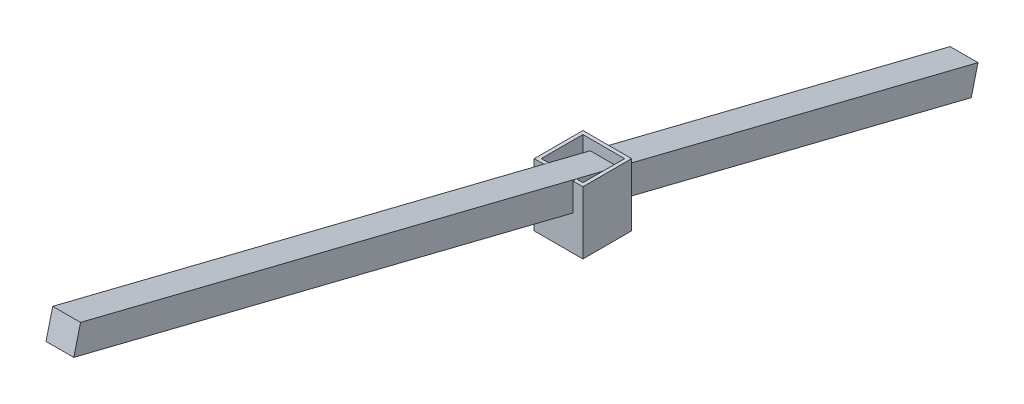
ISO-10303-21;
HEADER;
FILE_DESCRIPTION(('STEP AP214'),'2;1');
FILE_NAME('part.step','',(''),(''),'','','');
FILE_SCHEMA(('AUTOMOTIVE_DESIGN { 1 0 10303 214 1 1 1 1 }'));
ENDSEC;
DATA;
#1=APPLICATION_CONTEXT('core data for automotive mechanical design processes');
#2=APPLICATION_PROTOCOL_DEFINITION('international standard','automotive_design',2000,#1);
#3=PRODUCT_CONTEXT('',#1,'mechanical');
#4=PRODUCT('Part','Part','',(#3));
#5=PRODUCT_RELATED_PRODUCT_CATEGORY('part','',(#4));
#6=PRODUCT_DEFINITION_FORMATION('','',#4);
#7=PRODUCT_DEFINITION_CONTEXT('part definition',#1,'design');
#8=PRODUCT_DEFINITION('design','',#6,#7);
#9=PRODUCT_DEFINITION_SHAPE('','',#8);
#10=(LENGTH_UNIT() NAMED_UNIT(*) SI_UNIT(.MILLI.,.METRE.));
#11=(NAMED_UNIT(*) PLANE_ANGLE_UNIT() SI_UNIT($,.RADIAN.));
#12=(NAMED_UNIT(*) SI_UNIT($,.STERADIAN.) SOLID_ANGLE_UNIT());
#13=UNCERTAINTY_MEASURE_WITH_UNIT(LENGTH_MEASURE(1.E-05),#10,'distance_accuracy_value','');
#14=(GEOMETRIC_REPRESENTATION_CONTEXT(3) GLOBAL_UNCERTAINTY_ASSIGNED_CONTEXT((#13)) GLOBAL_UNIT_ASSIGNED_CONTEXT((#10,
#11,#12)) REPRESENTATION_CONTEXT('',''));
#15=CARTESIAN_POINT('',(0.,0.,0.));
#16=DIRECTION('',(0.,0.,1.));
#17=DIRECTION('',(1.,0.,0.));
#18=AXIS2_PLACEMENT_3D('',#15,#16,#17);
#19=CARTESIAN_POINT('',(-17.5,-45.,-17.5));
#20=DIRECTION('',(0.,0.,-1.));
#21=DIRECTION('',(-1.,0.,0.));
#22=AXIS2_PLACEMENT_3D('',#19,#20,#21);
#23=PLANE('',#22);
#24=DIRECTION('',(0.,-1.,0.));
#25=VECTOR('',#24,1.);
#26=CARTESIAN_POINT('',(10.25,-45.,-17.5));
#27=LINE('',#26,#25);
#28=CARTESIAN_POINT('',(10.25,-8.10316009240324,-17.5));
#29=VERTEX_POINT('',#28);
#30=CARTESIAN_POINT('',(10.25,-28.7154326794012,-17.5));
#31=VERTEX_POINT('',#30);
#32=EDGE_CURVE('E49',#29,#31,#27,.T.);
#33=ORIENTED_EDGE('',*,*,#32,.F.);
#34=DIRECTION('',(1.,0.,0.));
#35=VECTOR('',#34,1.);
#36=CARTESIAN_POINT('',(-17.5,-8.10316009240324,-17.5));
#37=LINE('',#36,#35);
#38=CARTESIAN_POINT('',(-9.74999999999999,-8.10316009240325,-17.5));
#39=VERTEX_POINT('',#38);
#40=EDGE_CURVE('E53',#39,#29,#37,.T.);
#41=ORIENTED_EDGE('',*,*,#40,.F.);
#42=DIRECTION('',(0.,1.,0.));
#43=VECTOR('',#42,1.);
#44=CARTESIAN_POINT('',(-9.74999999999998,-45.,-17.5));
#45=LINE('',#44,#43);
#46=CARTESIAN_POINT('',(-9.74999999999998,-28.7154326794012,-17.5000000000001));
#47=VERTEX_POINT('',#46);
#48=EDGE_CURVE('E240',#47,#39,#45,.T.);
#49=ORIENTED_EDGE('',*,*,#48,.F.);
#50=DIRECTION('',(-1.,0.,0.));
#51=VECTOR('',#50,1.);
#52=CARTESIAN_POINT('',(-17.5,-28.7154326794012,-17.5));
#53=LINE('',#52,#51);
#54=EDGE_CURVE('E230',#31,#47,#53,.T.);
#55=ORIENTED_EDGE('',*,*,#54,.F.);
#56=EDGE_LOOP('',(#33,#41,#49,#55));
#57=FACE_BOUND('',#56,.T.);
#58=DIRECTION('',(-1.,0.,0.));
#59=VECTOR('',#58,1.);
#60=CARTESIAN_POINT('',(-17.5,0.,-17.5));
#61=LINE('',#60,#59);
#62=CARTESIAN_POINT('',(17.5,0.,-17.5));
#63=VERTEX_POINT('',#62);
#64=CARTESIAN_POINT('',(-17.5,0.,-17.5));
#65=VERTEX_POINT('',#64);
#66=EDGE_CURVE('E280',#63,#65,#61,.T.);
#67=ORIENTED_EDGE('',*,*,#66,.F.);
#68=DIRECTION('',(0.,1.,0.));
#69=VECTOR('',#68,1.);
#70=CARTESIAN_POINT('',(17.5,-45.,-17.5));
#71=LINE('',#70,#69);
#72=CARTESIAN_POINT('',(17.5,-45.,-17.5));
#73=VERTEX_POINT('',#72);
#74=EDGE_CURVE('E312',#73,#63,#71,.T.);
#75=ORIENTED_EDGE('',*,*,#74,.F.);
#76=DIRECTION('',(-1.,0.,0.));
#77=VECTOR('',#76,1.);
#78=CARTESIAN_POINT('',(-17.5,-45.,-17.5));
#79=LINE('',#78,#77);
#80=CARTESIAN_POINT('',(-17.5,-45.,-17.5));
#81=VERTEX_POINT('',#80);
#82=EDGE_CURVE('E287',#73,#81,#79,.T.);
#83=ORIENTED_EDGE('',*,*,#82,.T.);
#84=DIRECTION('',(0.,1.,0.));
#85=VECTOR('',#84,1.);
#86=CARTESIAN_POINT('',(-17.5,-45.,-17.5));
#87=LINE('',#86,#85);
#88=EDGE_CURVE('E300',#81,#65,#87,.T.);
#89=ORIENTED_EDGE('',*,*,#88,.T.);
#90=EDGE_LOOP('',(#67,#75,#83,#89));
#91=FACE_BOUND('',#90,.T.);
#92=ADVANCED_FACE('F35',(#57,#91),#23,.T.);
#93=CARTESIAN_POINT('',(17.5,-45.,-17.5));
#94=DIRECTION('',(1.,0.,0.));
#95=DIRECTION('',(0.,0.,-1.));
#96=AXIS2_PLACEMENT_3D('',#93,#94,#95);
#97=PLANE('',#96);
#98=DIRECTION('',(0.,0.,-1.));
#99=VECTOR('',#98,1.);
#100=CARTESIAN_POINT('',(17.5,0.,-17.5));
#101=LINE('',#100,#99);
#102=CARTESIAN_POINT('',(17.5,0.,17.5));
#103=VERTEX_POINT('',#102);
#104=EDGE_CURVE('E291',#103,#63,#101,.T.);
#105=ORIENTED_EDGE('',*,*,#104,.F.);
#106=DIRECTION('',(0.,1.,0.));
#107=VECTOR('',#106,1.);
#108=CARTESIAN_POINT('',(17.5,-45.,17.5));
#109=LINE('',#108,#107);
#110=CARTESIAN_POINT('',(17.5,-45.,17.5));
#111=VERTEX_POINT('',#110);
#112=EDGE_CURVE('E315',#111,#103,#109,.T.);
#113=ORIENTED_EDGE('',*,*,#112,.F.);
#114=DIRECTION('',(0.,0.,-1.));
#115=VECTOR('',#114,1.);
#116=CARTESIAN_POINT('',(17.5,-45.,-17.5));
#117=LINE('',#116,#115);
#118=EDGE_CURVE('E297',#111,#73,#117,.T.);
#119=ORIENTED_EDGE('',*,*,#118,.T.);
#120=ORIENTED_EDGE('',*,*,#74,.T.);
#121=EDGE_LOOP('',(#105,#113,#119,#120));
#122=FACE_BOUND('',#121,.T.);
#123=ADVANCED_FACE('F358',(#122),#97,.T.);
#124=CARTESIAN_POINT('',(-17.5,-45.,17.5));
#125=DIRECTION('',(0.,0.,1.));
#126=DIRECTION('',(1.,0.,0.));
#127=AXIS2_PLACEMENT_3D('',#124,#125,#126);
#128=PLANE('',#127);
#129=DIRECTION('',(0.,1.,0.));
#130=VECTOR('',#129,1.);
#131=CARTESIAN_POINT('',(10.25,-45.,17.5));
#132=LINE('',#131,#130);
#133=CARTESIAN_POINT('',(10.25,-19.9889525798901,17.5));
#134=VERTEX_POINT('',#133);
#135=CARTESIAN_POINT('',(10.25,0.,17.5));
#136=VERTEX_POINT('',#135);
#137=EDGE_CURVE('E249',#134,#136,#132,.T.);
#138=ORIENTED_EDGE('',*,*,#137,.F.);
#139=DIRECTION('',(1.,0.,0.));
#140=VECTOR('',#139,1.);
#141=CARTESIAN_POINT('',(-17.5,-19.9889525798901,17.5));
#142=LINE('',#141,#140);
#143=CARTESIAN_POINT('',(-9.74999999999998,-19.9889525798901,17.5));
#144=VERTEX_POINT('',#143);
#145=EDGE_CURVE('E228',#144,#134,#142,.T.);
#146=ORIENTED_EDGE('',*,*,#145,.F.);
#147=DIRECTION('',(0.,-1.,0.));
#148=VECTOR('',#147,1.);
#149=CARTESIAN_POINT('',(-9.74999999999998,-45.,17.5));
#150=LINE('',#149,#148);
#151=CARTESIAN_POINT('',(-9.74999999999999,0.,17.5));
#152=VERTEX_POINT('',#151);
#153=EDGE_CURVE('E238',#152,#144,#150,.T.);
#154=ORIENTED_EDGE('',*,*,#153,.F.);
#155=DIRECTION('',(1.,0.,0.));
#156=VECTOR('',#155,1.);
#157=CARTESIAN_POINT('',(-17.5,0.,17.5));
#158=LINE('',#157,#156);
#159=CARTESIAN_POINT('',(-17.5,0.,17.5));
#160=VERTEX_POINT('',#159);
#161=EDGE_CURVE('E307',#160,#152,#158,.T.);
#162=ORIENTED_EDGE('',*,*,#161,.F.);
#163=DIRECTION('',(0.,1.,0.));
#164=VECTOR('',#163,1.);
#165=CARTESIAN_POINT('',(-17.5,-45.,17.5));
#166=LINE('',#165,#164);
#167=CARTESIAN_POINT('',(-17.5,-45.,17.5));
#168=VERTEX_POINT('',#167);
#169=EDGE_CURVE('E318',#168,#160,#166,.T.);
#170=ORIENTED_EDGE('',*,*,#169,.F.);
#171=DIRECTION('',(1.,0.,0.));
#172=VECTOR('',#171,1.);
#173=CARTESIAN_POINT('',(-17.5,-45.,17.5));
#174=LINE('',#173,#172);
#175=EDGE_CURVE('E294',#168,#111,#174,.T.);
#176=ORIENTED_EDGE('',*,*,#175,.T.);
#177=ORIENTED_EDGE('',*,*,#112,.T.);
#178=EDGE_CURVE('E306',#136,#103,#158,.T.);
#179=ORIENTED_EDGE('',*,*,#178,.F.);
#180=EDGE_LOOP('',(#138,#146,#154,#162,#170,#176,#177,#179));
#181=FACE_BOUND('',#180,.T.);
#182=ADVANCED_FACE('F364',(#181),#128,.T.);
#183=CARTESIAN_POINT('',(-17.5,-45.,-17.5));
#184=DIRECTION('',(-1.,0.,0.));
#185=DIRECTION('',(0.,0.,1.));
#186=AXIS2_PLACEMENT_3D('',#183,#184,#185);
#187=PLANE('',#186);
#188=DIRECTION('',(0.,0.,1.));
#189=VECTOR('',#188,1.);
#190=CARTESIAN_POINT('',(-17.5,0.,-17.5));
#191=LINE('',#190,#189);
#192=EDGE_CURVE('E303',#65,#160,#191,.T.);
#193=ORIENTED_EDGE('',*,*,#192,.F.);
#194=ORIENTED_EDGE('',*,*,#88,.F.);
#195=DIRECTION('',(0.,0.,1.));
#196=VECTOR('',#195,1.);
#197=CARTESIAN_POINT('',(-17.5,-45.,-17.5));
#198=LINE('',#197,#196);
#199=EDGE_CURVE('E290',#81,#168,#198,.T.);
#200=ORIENTED_EDGE('',*,*,#199,.T.);
#201=ORIENTED_EDGE('',*,*,#169,.T.);
#202=EDGE_LOOP('',(#193,#194,#200,#201));
#203=FACE_BOUND('',#202,.T.);
#204=ADVANCED_FACE('F382',(#203),#187,.T.);
#205=CARTESIAN_POINT('',(0.,-45.,0.));
#206=DIRECTION('',(0.,-1.,0.));
#207=DIRECTION('',(0.,0.,-1.));
#208=AXIS2_PLACEMENT_3D('',#205,#206,#207);
#209=PLANE('',#208);
#210=DIRECTION('',(0.,0.,-1.));
#211=VECTOR('',#210,1.);
#212=CARTESIAN_POINT('',(15.,-45.,-15.));
#213=LINE('',#212,#211);
#214=CARTESIAN_POINT('',(15.,-45.,15.));
#215=VERTEX_POINT('',#214);
#216=CARTESIAN_POINT('',(15.,-45.,-15.));
#217=VERTEX_POINT('',#216);
#218=EDGE_CURVE('E253',#215,#217,#213,.T.);
#219=ORIENTED_EDGE('',*,*,#218,.T.);
#220=DIRECTION('',(-1.,0.,0.));
#221=VECTOR('',#220,1.);
#222=CARTESIAN_POINT('',(-15.,-45.,-15.));
#223=LINE('',#222,#221);
#224=CARTESIAN_POINT('',(-15.,-45.,-15.));
#225=VERTEX_POINT('',#224);
#226=EDGE_CURVE('E256',#217,#225,#223,.T.);
#227=ORIENTED_EDGE('',*,*,#226,.T.);
#228=DIRECTION('',(0.,0.,1.));
#229=VECTOR('',#228,1.);
#230=CARTESIAN_POINT('',(-15.,-45.,-15.));
#231=LINE('',#230,#229);
#232=CARTESIAN_POINT('',(-15.,-45.,15.));
#233=VERTEX_POINT('',#232);
#234=EDGE_CURVE('E260',#225,#233,#231,.T.);
#235=ORIENTED_EDGE('',*,*,#234,.T.);
#236=DIRECTION('',(1.,0.,0.));
#237=VECTOR('',#236,1.);
#238=CARTESIAN_POINT('',(-15.,-45.,15.));
#239=LINE('',#238,#237);
#240=EDGE_CURVE('E263',#233,#215,#239,.T.);
#241=ORIENTED_EDGE('',*,*,#240,.T.);
#242=EDGE_LOOP('',(#219,#227,#235,#241));
#243=FACE_BOUND('',#242,.T.);
#244=ORIENTED_EDGE('',*,*,#82,.F.);
#245=ORIENTED_EDGE('',*,*,#118,.F.);
#246=ORIENTED_EDGE('',*,*,#175,.F.);
#247=ORIENTED_EDGE('',*,*,#199,.F.);
#248=EDGE_LOOP('',(#244,#245,#246,#247));
#249=FACE_BOUND('',#248,.T.);
#250=ADVANCED_FACE('F379',(#243,#249),#209,.T.);
#251=CARTESIAN_POINT('',(0.,0.,0.));
#252=DIRECTION('',(0.,-1.,0.));
#253=DIRECTION('',(0.,0.,-1.));
#254=AXIS2_PLACEMENT_3D('',#251,#252,#253);
#255=PLANE('',#254);
#256=DIRECTION('',(1.,0.,0.));
#257=VECTOR('',#256,1.);
#258=CARTESIAN_POINT('',(-15.,0.,15.));
#259=LINE('',#258,#257);
#260=CARTESIAN_POINT('',(10.25,-1.11022302462516E-13,15.));
#261=VERTEX_POINT('',#260);
#262=CARTESIAN_POINT('',(15.,0.,15.));
#263=VERTEX_POINT('',#262);
#264=EDGE_CURVE('E274',#261,#263,#259,.T.);
#265=ORIENTED_EDGE('',*,*,#264,.F.);
#266=DIRECTION('',(0.,0.,1.));
#267=VECTOR('',#266,1.);
#268=CARTESIAN_POINT('',(10.25,0.,0.));
#269=LINE('',#268,#267);
#270=EDGE_CURVE('E246',#261,#136,#269,.T.);
#271=ORIENTED_EDGE('',*,*,#270,.T.);
#272=ORIENTED_EDGE('',*,*,#178,.T.);
#273=ORIENTED_EDGE('',*,*,#104,.T.);
#274=ORIENTED_EDGE('',*,*,#66,.T.);
#275=ORIENTED_EDGE('',*,*,#192,.T.);
#276=ORIENTED_EDGE('',*,*,#161,.T.);
#277=DIRECTION('',(0.,0.,-1.));
#278=VECTOR('',#277,1.);
#279=CARTESIAN_POINT('',(-9.74999999999999,0.,0.));
#280=LINE('',#279,#278);
#281=CARTESIAN_POINT('',(-9.74999999999999,0.,15.));
#282=VERTEX_POINT('',#281);
#283=EDGE_CURVE('E235',#152,#282,#280,.T.);
#284=ORIENTED_EDGE('',*,*,#283,.T.);
#285=CARTESIAN_POINT('',(-15.,0.,15.));
#286=VERTEX_POINT('',#285);
#287=EDGE_CURVE('E257',#286,#282,#259,.T.);
#288=ORIENTED_EDGE('',*,*,#287,.F.);
#289=DIRECTION('',(0.,0.,1.));
#290=VECTOR('',#289,1.);
#291=CARTESIAN_POINT('',(-15.,0.,-15.));
#292=LINE('',#291,#290);
#293=CARTESIAN_POINT('',(-15.,0.,-15.));
#294=VERTEX_POINT('',#293);
#295=EDGE_CURVE('E271',#294,#286,#292,.T.);
#296=ORIENTED_EDGE('',*,*,#295,.F.);
#297=DIRECTION('',(-1.,0.,0.));
#298=VECTOR('',#297,1.);
#299=CARTESIAN_POINT('',(-15.,0.,-15.));
#300=LINE('',#299,#298);
#301=CARTESIAN_POINT('',(15.,0.,-15.));
#302=VERTEX_POINT('',#301);
#303=EDGE_CURVE('E268',#302,#294,#300,.T.);
#304=ORIENTED_EDGE('',*,*,#303,.F.);
#305=DIRECTION('',(0.,0.,-1.));
#306=VECTOR('',#305,1.);
#307=CARTESIAN_POINT('',(15.,0.,-15.));
#308=LINE('',#307,#306);
#309=EDGE_CURVE('E252',#263,#302,#308,.T.);
#310=ORIENTED_EDGE('',*,*,#309,.F.);
#311=EDGE_LOOP('',(#265,#271,#272,#273,#274,#275,#276,#284,#288,#296,#304,#310));
#312=FACE_BOUND('',#311,.T.);
#313=ADVANCED_FACE('F374',(#312),#255,.F.);
#314=CARTESIAN_POINT('',(15.,-45.,-15.));
#315=DIRECTION('',(1.,0.,0.));
#316=DIRECTION('',(0.,0.,-1.));
#317=AXIS2_PLACEMENT_3D('',#314,#315,#316);
#318=PLANE('',#317);
#319=ORIENTED_EDGE('',*,*,#309,.T.);
#320=DIRECTION('',(0.,1.,0.));
#321=VECTOR('',#320,1.);
#322=CARTESIAN_POINT('',(15.,-45.,-15.));
#323=LINE('',#322,#321);
#324=EDGE_CURVE('E266',#217,#302,#323,.T.);
#325=ORIENTED_EDGE('',*,*,#324,.F.);
#326=ORIENTED_EDGE('',*,*,#218,.F.);
#327=DIRECTION('',(0.,1.,0.));
#328=VECTOR('',#327,1.);
#329=CARTESIAN_POINT('',(15.,-45.,15.));
#330=LINE('',#329,#328);
#331=EDGE_CURVE('E277',#215,#263,#330,.T.);
#332=ORIENTED_EDGE('',*,*,#331,.T.);
#333=EDGE_LOOP('',(#319,#325,#326,#332));
#334=FACE_BOUND('',#333,.T.);
#335=ADVANCED_FACE('F408',(#334),#318,.F.);
#336=CARTESIAN_POINT('',(-15.,-45.,15.));
#337=DIRECTION('',(0.,0.,1.));
#338=DIRECTION('',(1.,0.,0.));
#339=AXIS2_PLACEMENT_3D('',#336,#337,#338);
#340=PLANE('',#339);
#341=DIRECTION('',(1.,0.,0.));
#342=VECTOR('',#341,1.);
#343=CARTESIAN_POINT('',(-15.,-20.612272586998,15.));
#344=LINE('',#343,#342);
#345=CARTESIAN_POINT('',(-9.74999999999998,-20.612272586998,15.));
#346=VERTEX_POINT('',#345);
#347=CARTESIAN_POINT('',(10.25,-20.612272586998,15.));
#348=VERTEX_POINT('',#347);
#349=EDGE_CURVE('E213',#346,#348,#344,.T.);
#350=ORIENTED_EDGE('',*,*,#349,.T.);
#351=DIRECTION('',(0.,1.,0.));
#352=VECTOR('',#351,1.);
#353=CARTESIAN_POINT('',(10.25,-45.,15.));
#354=LINE('',#353,#352);
#355=EDGE_CURVE('E243',#348,#261,#354,.T.);
#356=ORIENTED_EDGE('',*,*,#355,.T.);
#357=ORIENTED_EDGE('',*,*,#264,.T.);
#358=ORIENTED_EDGE('',*,*,#331,.F.);
#359=ORIENTED_EDGE('',*,*,#240,.F.);
#360=DIRECTION('',(0.,1.,0.));
#361=VECTOR('',#360,1.);
#362=CARTESIAN_POINT('',(-15.,-45.,15.));
#363=LINE('',#362,#361);
#364=EDGE_CURVE('E281',#233,#286,#363,.T.);
#365=ORIENTED_EDGE('',*,*,#364,.T.);
#366=ORIENTED_EDGE('',*,*,#287,.T.);
#367=DIRECTION('',(0.,-1.,0.));
#368=VECTOR('',#367,1.);
#369=CARTESIAN_POINT('',(-9.74999999999998,-45.,15.));
#370=LINE('',#369,#368);
#371=EDGE_CURVE('E232',#282,#346,#370,.T.);
#372=ORIENTED_EDGE('',*,*,#371,.T.);
#373=EDGE_LOOP('',(#350,#356,#357,#358,#359,#365,#366,#372));
#374=FACE_BOUND('',#373,.T.);
#375=ADVANCED_FACE('F401',(#374),#340,.F.);
#376=CARTESIAN_POINT('',(-15.,-45.,-15.));
#377=DIRECTION('',(-1.,0.,0.));
#378=DIRECTION('',(0.,0.,1.));
#379=AXIS2_PLACEMENT_3D('',#376,#377,#378);
#380=PLANE('',#379);
#381=ORIENTED_EDGE('',*,*,#295,.T.);
#382=ORIENTED_EDGE('',*,*,#364,.F.);
#383=ORIENTED_EDGE('',*,*,#234,.F.);
#384=DIRECTION('',(0.,1.,0.));
#385=VECTOR('',#384,1.);
#386=CARTESIAN_POINT('',(-15.,-45.,-15.));
#387=LINE('',#386,#385);
#388=EDGE_CURVE('E283',#225,#294,#387,.T.);
#389=ORIENTED_EDGE('',*,*,#388,.T.);
#390=EDGE_LOOP('',(#381,#382,#383,#389));
#391=FACE_BOUND('',#390,.T.);
#392=ADVANCED_FACE('F415',(#391),#380,.F.);
#393=CARTESIAN_POINT('',(-15.,-45.,-15.));
#394=DIRECTION('',(0.,0.,-1.));
#395=DIRECTION('',(-1.,0.,0.));
#396=AXIS2_PLACEMENT_3D('',#393,#394,#395);
#397=PLANE('',#396);
#398=DIRECTION('',(1.,0.,0.));
#399=VECTOR('',#398,1.);
#400=CARTESIAN_POINT('',(-15.,-7.47984008529531,-15.));
#401=LINE('',#400,#399);
#402=CARTESIAN_POINT('',(-9.74999999999999,-7.47984008529531,-15.));
#403=VERTEX_POINT('',#402);
#404=CARTESIAN_POINT('',(10.25,-7.47984008529533,-15.));
#405=VERTEX_POINT('',#404);
#406=EDGE_CURVE('E42',#403,#405,#401,.T.);
#407=ORIENTED_EDGE('',*,*,#406,.T.);
#408=DIRECTION('',(0.,-1.,0.));
#409=VECTOR('',#408,1.);
#410=CARTESIAN_POINT('',(10.25,-45.,-15.));
#411=LINE('',#410,#409);
#412=CARTESIAN_POINT('',(10.25,-28.0921126722933,-15.));
#413=VERTEX_POINT('',#412);
#414=EDGE_CURVE('E11',#405,#413,#411,.T.);
#415=ORIENTED_EDGE('',*,*,#414,.T.);
#416=DIRECTION('',(-1.,0.,0.));
#417=VECTOR('',#416,1.);
#418=CARTESIAN_POINT('',(-15.,-28.0921126722933,-15.));
#419=LINE('',#418,#417);
#420=CARTESIAN_POINT('',(-9.75000000000001,-28.0921126722933,-15.));
#421=VERTEX_POINT('',#420);
#422=EDGE_CURVE('E314',#413,#421,#419,.T.);
#423=ORIENTED_EDGE('',*,*,#422,.T.);
#424=DIRECTION('',(0.,1.,0.));
#425=VECTOR('',#424,1.);
#426=CARTESIAN_POINT('',(-9.74999999999998,-45.,-15.));
#427=LINE('',#426,#425);
#428=EDGE_CURVE('E323',#421,#403,#427,.T.);
#429=ORIENTED_EDGE('',*,*,#428,.T.);
#430=EDGE_LOOP('',(#407,#415,#423,#429));
#431=FACE_BOUND('',#430,.T.);
#432=ORIENTED_EDGE('',*,*,#303,.T.);
#433=ORIENTED_EDGE('',*,*,#388,.F.);
#434=ORIENTED_EDGE('',*,*,#226,.F.);
#435=ORIENTED_EDGE('',*,*,#324,.T.);
#436=EDGE_LOOP('',(#432,#433,#434,#435));
#437=FACE_BOUND('',#436,.T.);
#438=ADVANCED_FACE('F327',(#431,#437),#397,.F.);
#439=CARTESIAN_POINT('',(0.,92.391402782736,370.561676703639));
#440=DIRECTION('',(0.,-0.241921895599661,-0.970295726275998));
#441=DIRECTION('',(0.,0.970295726275998,-0.241921895599661));
#442=AXIS2_PLACEMENT_3D('',#439,#440,#441);
#443=PLANE('',#442);
#444=DIRECTION('',(0.,-0.970295726275998,0.241921895599661));
#445=VECTOR('',#444,1.);
#446=CARTESIAN_POINT('',(10.25,88.8703660618418,371.439569757197));
#447=LINE('',#446,#445);
#448=CARTESIAN_POINT('',(10.25,88.8703660618418,371.439569757197));
#449=VERTEX_POINT('',#448);
#450=CARTESIAN_POINT('',(10.25,69.4644515363218,376.27800766919));
#451=VERTEX_POINT('',#450);
#452=EDGE_CURVE('E199',#449,#451,#447,.T.);
#453=ORIENTED_EDGE('',*,*,#452,.F.);
#454=DIRECTION('',(1.,0.,0.));
#455=VECTOR('',#454,1.);
#456=CARTESIAN_POINT('',(10.25,88.8703660618418,371.439569757197));
#457=LINE('',#456,#455);
#458=CARTESIAN_POINT('',(-9.75000000000001,88.8703660618418,371.439569757197));
#459=VERTEX_POINT('',#458);
#460=EDGE_CURVE('E178',#459,#449,#457,.T.);
#461=ORIENTED_EDGE('',*,*,#460,.F.);
#462=DIRECTION('',(0.,0.970295726275998,-0.241921895599661));
#463=VECTOR('',#462,1.);
#464=CARTESIAN_POINT('',(-9.75000000000001,88.8703660618418,371.439569757197));
#465=LINE('',#464,#463);
#466=CARTESIAN_POINT('',(-9.75000000000001,69.4644515363218,376.27800766919));
#467=VERTEX_POINT('',#466);
#468=EDGE_CURVE('E205',#467,#459,#465,.T.);
#469=ORIENTED_EDGE('',*,*,#468,.F.);
#470=DIRECTION('',(-1.,0.,0.));
#471=VECTOR('',#470,1.);
#472=CARTESIAN_POINT('',(10.25,69.4644515363218,376.27800766919));
#473=LINE('',#472,#471);
#474=EDGE_CURVE('E202',#451,#467,#473,.T.);
#475=ORIENTED_EDGE('',*,*,#474,.F.);
#476=EDGE_LOOP('',(#453,#461,#469,#475));
#477=FACE_BOUND('',#476,.T.);
#478=ADVANCED_FACE('F396',(#477),#443,.F.);
#479=CARTESIAN_POINT('',(10.25,88.8703660618418,371.439569757197));
#480=DIRECTION('',(1.,0.,0.));
#481=DIRECTION('',(0.,1.,0.));
#482=AXIS2_PLACEMENT_3D('',#479,#480,#481);
#483=PLANE('',#482);
#484=DIRECTION('',(0.,-0.241921895599661,-0.970295726275998));
#485=VECTOR('',#484,1.);
#486=CARTESIAN_POINT('',(10.25,69.4644515363218,376.27800766919));
#487=LINE('',#486,#485);
#488=EDGE_CURVE('E180',#451,#134,#487,.T.);
#489=ORIENTED_EDGE('',*,*,#488,.T.);
#490=ORIENTED_EDGE('',*,*,#137,.T.);
#491=ORIENTED_EDGE('',*,*,#270,.F.);
#492=DIRECTION('',(0.,-0.241921895599661,-0.970295726275998));
#493=VECTOR('',#492,1.);
#494=CARTESIAN_POINT('',(10.25,88.8703660618418,371.439569757197));
#495=LINE('',#494,#493);
#496=EDGE_CURVE('E210',#449,#261,#495,.T.);
#497=ORIENTED_EDGE('',*,*,#496,.F.);
#498=ORIENTED_EDGE('',*,*,#452,.T.);
#499=EDGE_LOOP('',(#489,#490,#491,#497,#498));
#500=FACE_BOUND('',#499,.T.);
#501=ADVANCED_FACE('F354',(#500),#483,.T.);
#502=CARTESIAN_POINT('',(-9.75000000000001,88.8703660618418,371.439569757197));
#503=DIRECTION('',(-1.,0.,0.));
#504=DIRECTION('',(0.,-1.,0.));
#505=AXIS2_PLACEMENT_3D('',#502,#503,#504);
#506=PLANE('',#505);
#507=ORIENTED_EDGE('',*,*,#283,.F.);
#508=ORIENTED_EDGE('',*,*,#153,.T.);
#509=DIRECTION('',(0.,-0.241921895599661,-0.970295726275998));
#510=VECTOR('',#509,1.);
#511=CARTESIAN_POINT('',(-9.75000000000001,69.4644515363218,376.27800766919));
#512=LINE('',#511,#510);
#513=EDGE_CURVE('E221',#467,#144,#512,.T.);
#514=ORIENTED_EDGE('',*,*,#513,.F.);
#515=ORIENTED_EDGE('',*,*,#468,.T.);
#516=DIRECTION('',(0.,-0.241921895599661,-0.970295726275998));
#517=VECTOR('',#516,1.);
#518=CARTESIAN_POINT('',(-9.75000000000001,88.8703660618418,371.439569757197));
#519=LINE('',#518,#517);
#520=EDGE_CURVE('E216',#459,#282,#519,.T.);
#521=ORIENTED_EDGE('',*,*,#520,.T.);
#522=EDGE_LOOP('',(#507,#508,#514,#515,#521));
#523=FACE_BOUND('',#522,.T.);
#524=ADVANCED_FACE('F351',(#523),#506,.T.);
#525=CARTESIAN_POINT('',(10.25,69.4644515363218,376.27800766919));
#526=DIRECTION('',(0.,-0.970295726275998,0.241921895599661));
#527=DIRECTION('',(0.,-0.241921895599661,-0.970295726275998));
#528=AXIS2_PLACEMENT_3D('',#525,#526,#527);
#529=PLANE('',#528);
#530=ORIENTED_EDGE('',*,*,#513,.T.);
#531=ORIENTED_EDGE('',*,*,#145,.T.);
#532=ORIENTED_EDGE('',*,*,#488,.F.);
#533=ORIENTED_EDGE('',*,*,#474,.T.);
#534=EDGE_LOOP('',(#530,#531,#532,#533));
#535=FACE_BOUND('',#534,.T.);
#536=ADVANCED_FACE('F392',(#535),#529,.T.);
#537=ORIENTED_EDGE('',*,*,#349,.F.);
#538=EDGE_CURVE('E223',#346,#421,#512,.T.);
#539=ORIENTED_EDGE('',*,*,#538,.T.);
#540=ORIENTED_EDGE('',*,*,#422,.F.);
#541=EDGE_CURVE('E177',#348,#413,#487,.T.);
#542=ORIENTED_EDGE('',*,*,#541,.F.);
#543=EDGE_LOOP('',(#537,#539,#540,#542));
#544=FACE_BOUND('',#543,.T.);
#545=ADVANCED_FACE('F491',(#544),#529,.T.);
#546=ORIENTED_EDGE('',*,*,#371,.F.);
#547=EDGE_CURVE('E219',#282,#403,#519,.T.);
#548=ORIENTED_EDGE('',*,*,#547,.T.);
#549=ORIENTED_EDGE('',*,*,#428,.F.);
#550=ORIENTED_EDGE('',*,*,#538,.F.);
#551=EDGE_LOOP('',(#546,#548,#549,#550));
#552=FACE_BOUND('',#551,.T.);
#553=ADVANCED_FACE('F337',(#552),#506,.T.);
#554=CARTESIAN_POINT('',(10.25,88.8703660618418,371.439569757197));
#555=DIRECTION('',(0.,0.970295726275998,-0.241921895599661));
#556=DIRECTION('',(0.,0.241921895599661,0.970295726275998));
#557=AXIS2_PLACEMENT_3D('',#554,#555,#556);
#558=PLANE('',#557);
#559=ORIENTED_EDGE('',*,*,#547,.F.);
#560=ORIENTED_EDGE('',*,*,#520,.F.);
#561=ORIENTED_EDGE('',*,*,#460,.T.);
#562=ORIENTED_EDGE('',*,*,#496,.T.);
#563=EDGE_CURVE('E214',#261,#405,#495,.T.);
#564=ORIENTED_EDGE('',*,*,#563,.T.);
#565=ORIENTED_EDGE('',*,*,#406,.F.);
#566=EDGE_LOOP('',(#559,#560,#561,#562,#564,#565));
#567=FACE_BOUND('',#566,.T.);
#568=ADVANCED_FACE('F334',(#567),#558,.T.);
#569=ORIENTED_EDGE('',*,*,#355,.F.);
#570=ORIENTED_EDGE('',*,*,#541,.T.);
#571=ORIENTED_EDGE('',*,*,#414,.F.);
#572=ORIENTED_EDGE('',*,*,#563,.F.);
#573=EDGE_LOOP('',(#569,#570,#571,#572));
#574=FACE_BOUND('',#573,.T.);
#575=ADVANCED_FACE('F352',(#574),#483,.T.);
#576=CARTESIAN_POINT('',(10.25,-72.0076945119329,-273.807088216342));
#577=VERTEX_POINT('',#576);
#578=EDGE_CURVE('E215',#29,#577,#495,.T.);
#579=ORIENTED_EDGE('',*,*,#578,.F.);
#580=ORIENTED_EDGE('',*,*,#32,.T.);
#581=CARTESIAN_POINT('',(10.25,-91.4136090374529,-268.968650304349));
#582=VERTEX_POINT('',#581);
#583=EDGE_CURVE('E169',#31,#582,#487,.T.);
#584=ORIENTED_EDGE('',*,*,#583,.T.);
#585=DIRECTION('',(0.,-0.970295726275998,0.241921895599661));
#586=VECTOR('',#585,1.);
#587=CARTESIAN_POINT('',(10.25,-72.0076945119329,-273.807088216342));
#588=LINE('',#587,#586);
#589=EDGE_CURVE('E174',#577,#582,#588,.T.);
#590=ORIENTED_EDGE('',*,*,#589,.F.);
#591=EDGE_LOOP('',(#579,#580,#584,#590));
#592=FACE_BOUND('',#591,.T.);
#593=ADVANCED_FACE('F172',(#592),#483,.T.);
#594=CARTESIAN_POINT('',(-9.74999999999997,-72.0076945119329,-273.807088216342));
#595=VERTEX_POINT('',#594);
#596=EDGE_CURVE('E220',#39,#595,#519,.T.);
#597=ORIENTED_EDGE('',*,*,#596,.F.);
#598=ORIENTED_EDGE('',*,*,#40,.T.);
#599=ORIENTED_EDGE('',*,*,#578,.T.);
#600=DIRECTION('',(1.,0.,0.));
#601=VECTOR('',#600,1.);
#602=CARTESIAN_POINT('',(10.25,-72.0076945119329,-273.807088216342));
#603=LINE('',#602,#601);
#604=EDGE_CURVE('E194',#595,#577,#603,.T.);
#605=ORIENTED_EDGE('',*,*,#604,.F.);
#606=EDGE_LOOP('',(#597,#598,#599,#605));
#607=FACE_BOUND('',#606,.T.);
#608=ADVANCED_FACE('F343',(#607),#558,.T.);
#609=CARTESIAN_POINT('',(-9.74999999999996,-91.4136090374529,-268.968650304349));
#610=VERTEX_POINT('',#609);
#611=EDGE_CURVE('E185',#47,#610,#512,.T.);
#612=ORIENTED_EDGE('',*,*,#611,.F.);
#613=ORIENTED_EDGE('',*,*,#48,.T.);
#614=ORIENTED_EDGE('',*,*,#596,.T.);
#615=DIRECTION('',(0.,0.970295726275998,-0.241921895599661));
#616=VECTOR('',#615,1.);
#617=CARTESIAN_POINT('',(-9.74999999999997,-72.0076945119329,-273.807088216342));
#618=LINE('',#617,#616);
#619=EDGE_CURVE('E189',#610,#595,#618,.T.);
#620=ORIENTED_EDGE('',*,*,#619,.F.);
#621=EDGE_LOOP('',(#612,#613,#614,#620));
#622=FACE_BOUND('',#621,.T.);
#623=ADVANCED_FACE('F341',(#622),#506,.T.);
#624=ORIENTED_EDGE('',*,*,#583,.F.);
#625=ORIENTED_EDGE('',*,*,#54,.T.);
#626=ORIENTED_EDGE('',*,*,#611,.T.);
#627=DIRECTION('',(-1.,0.,0.));
#628=VECTOR('',#627,1.);
#629=CARTESIAN_POINT('',(10.25,-91.4136090374529,-268.968650304349));
#630=LINE('',#629,#628);
#631=EDGE_CURVE('E182',#582,#610,#630,.T.);
#632=ORIENTED_EDGE('',*,*,#631,.F.);
#633=EDGE_LOOP('',(#624,#625,#626,#632));
#634=FACE_BOUND('',#633,.T.);
#635=ADVANCED_FACE('F183',(#634),#529,.T.);
#636=CARTESIAN_POINT('',(0.,-68.4866577910387,-274.6849812699));
#637=DIRECTION('',(0.,-0.241921895599661,-0.970295726275998));
#638=DIRECTION('',(0.,0.970295726275998,-0.241921895599661));
#639=AXIS2_PLACEMENT_3D('',#636,#637,#638);
#640=PLANE('',#639);
#641=ORIENTED_EDGE('',*,*,#589,.T.);
#642=ORIENTED_EDGE('',*,*,#631,.T.);
#643=ORIENTED_EDGE('',*,*,#619,.T.);
#644=ORIENTED_EDGE('',*,*,#604,.T.);
#645=EDGE_LOOP('',(#641,#642,#643,#644));
#646=FACE_BOUND('',#645,.T.);
#647=ADVANCED_FACE('F192',(#646),#640,.T.);
#648=CLOSED_SHELL('',(#92,#123,#182,#204,#250,#313,#335,#375,#392,#438,#478,#501,#524,#536,#545,
#553,#568,#575,#593,#608,#623,#635,#647));
#649=MANIFOLD_SOLID_BREP('B2',#648);
#650=ADVANCED_BREP_SHAPE_REPRESENTATION('',(#18,#649),#14);
#651=SHAPE_DEFINITION_REPRESENTATION(#9,#650);
ENDSEC;
END-ISO-10303-21;
